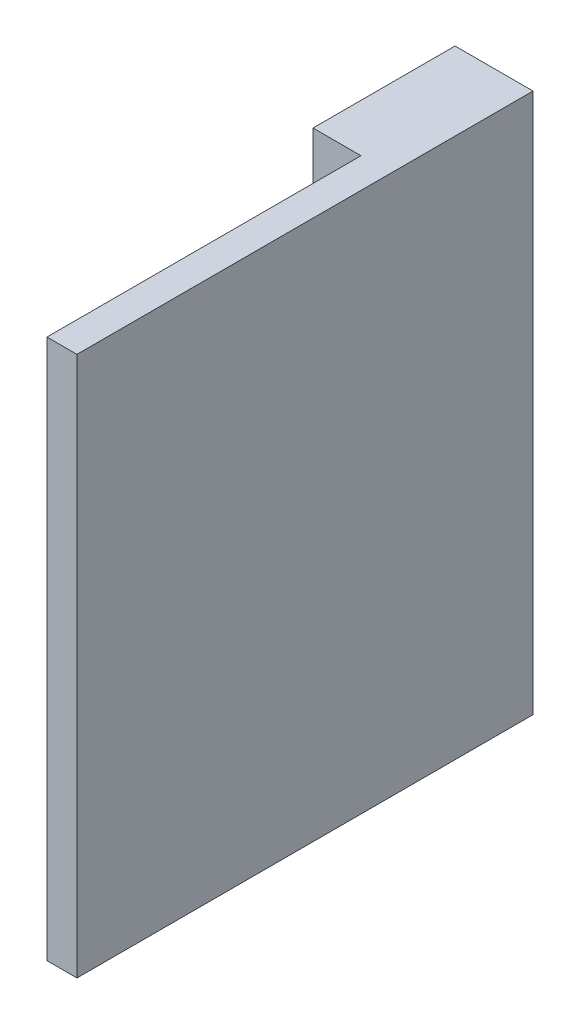
ISO-10303-21;
HEADER;
FILE_DESCRIPTION(('STEP AP214'),'2;1');
FILE_NAME('part.step','',(''),(''),'','','');
FILE_SCHEMA(('AUTOMOTIVE_DESIGN { 1 0 10303 214 1 1 1 1 }'));
ENDSEC;
DATA;
#1=APPLICATION_CONTEXT('core data for automotive mechanical design processes');
#2=APPLICATION_PROTOCOL_DEFINITION('international standard','automotive_design',2000,#1);
#3=PRODUCT_CONTEXT('',#1,'mechanical');
#4=PRODUCT('Part','Part','',(#3));
#5=PRODUCT_RELATED_PRODUCT_CATEGORY('part','',(#4));
#6=PRODUCT_DEFINITION_FORMATION('','',#4);
#7=PRODUCT_DEFINITION_CONTEXT('part definition',#1,'design');
#8=PRODUCT_DEFINITION('design','',#6,#7);
#9=PRODUCT_DEFINITION_SHAPE('','',#8);
#10=(LENGTH_UNIT() NAMED_UNIT(*) SI_UNIT(.MILLI.,.METRE.));
#11=(NAMED_UNIT(*) PLANE_ANGLE_UNIT() SI_UNIT($,.RADIAN.));
#12=(NAMED_UNIT(*) SI_UNIT($,.STERADIAN.) SOLID_ANGLE_UNIT());
#13=UNCERTAINTY_MEASURE_WITH_UNIT(LENGTH_MEASURE(1.E-05),#10,'distance_accuracy_value','');
#14=(GEOMETRIC_REPRESENTATION_CONTEXT(3) GLOBAL_UNCERTAINTY_ASSIGNED_CONTEXT((#13)) GLOBAL_UNIT_ASSIGNED_CONTEXT((#10,
#11,#12)) REPRESENTATION_CONTEXT('',''));
#15=CARTESIAN_POINT('',(0.,0.,0.));
#16=DIRECTION('',(0.,0.,1.));
#17=DIRECTION('',(1.,0.,0.));
#18=AXIS2_PLACEMENT_3D('',#15,#16,#17);
#19=CARTESIAN_POINT('',(0.,2700.,-1570.));
#20=DIRECTION('',(1.,0.,0.));
#21=DIRECTION('',(0.,0.,-1.));
#22=AXIS2_PLACEMENT_3D('',#19,#20,#21);
#23=PLANE('',#22);
#24=DIRECTION('',(0.,0.,1.));
#25=VECTOR('',#24,1.);
#26=CARTESIAN_POINT('',(0.,0.,-1570.));
#27=LINE('',#26,#25);
#28=CARTESIAN_POINT('',(0.,0.,-1570.));
#29=VERTEX_POINT('',#28);
#30=CARTESIAN_POINT('',(0.,0.,0.));
#31=VERTEX_POINT('',#30);
#32=EDGE_CURVE('E117',#29,#31,#27,.T.);
#33=ORIENTED_EDGE('',*,*,#32,.T.);
#34=DIRECTION('',(0.,-1.,0.));
#35=VECTOR('',#34,1.);
#36=CARTESIAN_POINT('',(0.,2700.,0.));
#37=LINE('',#36,#35);
#38=CARTESIAN_POINT('',(0.,2700.,0.));
#39=VERTEX_POINT('',#38);
#40=EDGE_CURVE('E11',#39,#31,#37,.T.);
#41=ORIENTED_EDGE('',*,*,#40,.F.);
#42=DIRECTION('',(0.,0.,1.));
#43=VECTOR('',#42,1.);
#44=CARTESIAN_POINT('',(0.,2700.,-1570.));
#45=LINE('',#44,#43);
#46=CARTESIAN_POINT('',(0.,2700.,-1570.));
#47=VERTEX_POINT('',#46);
#48=EDGE_CURVE('E127',#47,#39,#45,.T.);
#49=ORIENTED_EDGE('',*,*,#48,.F.);
#50=DIRECTION('',(0.,-1.,0.));
#51=VECTOR('',#50,1.);
#52=CARTESIAN_POINT('',(0.,2700.,-1570.));
#53=LINE('',#52,#51);
#54=EDGE_CURVE('E113',#47,#29,#53,.T.);
#55=ORIENTED_EDGE('',*,*,#54,.T.);
#56=EDGE_LOOP('',(#33,#41,#49,#55));
#57=FACE_BOUND('',#56,.T.);
#58=ADVANCED_FACE('F33',(#57),#23,.F.);
#59=CARTESIAN_POINT('',(0.,2700.,0.));
#60=DIRECTION('',(0.,0.,-1.));
#61=DIRECTION('',(-1.,0.,0.));
#62=AXIS2_PLACEMENT_3D('',#59,#60,#61);
#63=PLANE('',#62);
#64=DIRECTION('',(1.,0.,0.));
#65=VECTOR('',#64,1.);
#66=CARTESIAN_POINT('',(0.,0.,0.));
#67=LINE('',#66,#65);
#68=CARTESIAN_POINT('',(150.,0.,0.));
#69=VERTEX_POINT('',#68);
#70=EDGE_CURVE('E120',#31,#69,#67,.T.);
#71=ORIENTED_EDGE('',*,*,#70,.T.);
#72=DIRECTION('',(0.,-1.,0.));
#73=VECTOR('',#72,1.);
#74=CARTESIAN_POINT('',(150.,2700.,0.));
#75=LINE('',#74,#73);
#76=CARTESIAN_POINT('',(150.,2700.,0.));
#77=VERTEX_POINT('',#76);
#78=EDGE_CURVE('E41',#77,#69,#75,.T.);
#79=ORIENTED_EDGE('',*,*,#78,.F.);
#80=DIRECTION('',(1.,0.,0.));
#81=VECTOR('',#80,1.);
#82=CARTESIAN_POINT('',(0.,2700.,0.));
#83=LINE('',#82,#81);
#84=EDGE_CURVE('E86',#39,#77,#83,.T.);
#85=ORIENTED_EDGE('',*,*,#84,.F.);
#86=ORIENTED_EDGE('',*,*,#40,.T.);
#87=EDGE_LOOP('',(#71,#79,#85,#86));
#88=FACE_BOUND('',#87,.T.);
#89=ADVANCED_FACE('F151',(#88),#63,.F.);
#90=CARTESIAN_POINT('',(150.,2700.,0.));
#91=DIRECTION('',(-1.,0.,0.));
#92=DIRECTION('',(0.,0.,1.));
#93=AXIS2_PLACEMENT_3D('',#90,#91,#92);
#94=PLANE('',#93);
#95=DIRECTION('',(0.,0.,-1.));
#96=VECTOR('',#95,1.);
#97=CARTESIAN_POINT('',(150.,0.,0.));
#98=LINE('',#97,#96);
#99=CARTESIAN_POINT('',(150.,0.,-2280.));
#100=VERTEX_POINT('',#99);
#101=EDGE_CURVE('E122',#69,#100,#98,.T.);
#102=ORIENTED_EDGE('',*,*,#101,.T.);
#103=DIRECTION('',(0.,-1.,0.));
#104=VECTOR('',#103,1.);
#105=CARTESIAN_POINT('',(150.,2700.,-2280.));
#106=LINE('',#105,#104);
#107=CARTESIAN_POINT('',(150.,2700.,-2280.));
#108=VERTEX_POINT('',#107);
#109=EDGE_CURVE('E108',#108,#100,#106,.T.);
#110=ORIENTED_EDGE('',*,*,#109,.F.);
#111=DIRECTION('',(0.,0.,-1.));
#112=VECTOR('',#111,1.);
#113=CARTESIAN_POINT('',(150.,2700.,0.));
#114=LINE('',#113,#112);
#115=EDGE_CURVE('E99',#77,#108,#114,.T.);
#116=ORIENTED_EDGE('',*,*,#115,.F.);
#117=ORIENTED_EDGE('',*,*,#78,.T.);
#118=EDGE_LOOP('',(#102,#110,#116,#117));
#119=FACE_BOUND('',#118,.T.);
#120=ADVANCED_FACE('F133',(#119),#94,.F.);
#121=CARTESIAN_POINT('',(150.,2700.,-2280.));
#122=DIRECTION('',(0.,0.,1.));
#123=DIRECTION('',(1.,0.,0.));
#124=AXIS2_PLACEMENT_3D('',#121,#122,#123);
#125=PLANE('',#124);
#126=DIRECTION('',(-1.,0.,0.));
#127=VECTOR('',#126,1.);
#128=CARTESIAN_POINT('',(150.,0.,-2280.));
#129=LINE('',#128,#127);
#130=CARTESIAN_POINT('',(-240.,0.,-2280.));
#131=VERTEX_POINT('',#130);
#132=EDGE_CURVE('E107',#100,#131,#129,.T.);
#133=ORIENTED_EDGE('',*,*,#132,.T.);
#134=DIRECTION('',(0.,-1.,0.));
#135=VECTOR('',#134,1.);
#136=CARTESIAN_POINT('',(-240.,2700.,-2280.));
#137=LINE('',#136,#135);
#138=CARTESIAN_POINT('',(-240.,2700.,-2280.));
#139=VERTEX_POINT('',#138);
#140=EDGE_CURVE('E104',#139,#131,#137,.T.);
#141=ORIENTED_EDGE('',*,*,#140,.F.);
#142=DIRECTION('',(-1.,0.,0.));
#143=VECTOR('',#142,1.);
#144=CARTESIAN_POINT('',(150.,2700.,-2280.));
#145=LINE('',#144,#143);
#146=EDGE_CURVE('E93',#108,#139,#145,.T.);
#147=ORIENTED_EDGE('',*,*,#146,.F.);
#148=ORIENTED_EDGE('',*,*,#109,.T.);
#149=EDGE_LOOP('',(#133,#141,#147,#148));
#150=FACE_BOUND('',#149,.T.);
#151=ADVANCED_FACE('F105',(#150),#125,.F.);
#152=CARTESIAN_POINT('',(-240.,2700.,-2280.));
#153=DIRECTION('',(1.,0.,0.));
#154=DIRECTION('',(0.,0.,-1.));
#155=AXIS2_PLACEMENT_3D('',#152,#153,#154);
#156=PLANE('',#155);
#157=DIRECTION('',(0.,0.,1.));
#158=VECTOR('',#157,1.);
#159=CARTESIAN_POINT('',(-240.,0.,-2280.));
#160=LINE('',#159,#158);
#161=CARTESIAN_POINT('',(-240.,0.,-1570.));
#162=VERTEX_POINT('',#161);
#163=EDGE_CURVE('E72',#131,#162,#160,.T.);
#164=ORIENTED_EDGE('',*,*,#163,.T.);
#165=DIRECTION('',(0.,-1.,0.));
#166=VECTOR('',#165,1.);
#167=CARTESIAN_POINT('',(-240.,2700.,-1570.));
#168=LINE('',#167,#166);
#169=CARTESIAN_POINT('',(-240.,2700.,-1570.));
#170=VERTEX_POINT('',#169);
#171=EDGE_CURVE('E109',#170,#162,#168,.T.);
#172=ORIENTED_EDGE('',*,*,#171,.F.);
#173=DIRECTION('',(0.,0.,1.));
#174=VECTOR('',#173,1.);
#175=CARTESIAN_POINT('',(-240.,2700.,-2280.));
#176=LINE('',#175,#174);
#177=EDGE_CURVE('E97',#139,#170,#176,.T.);
#178=ORIENTED_EDGE('',*,*,#177,.F.);
#179=ORIENTED_EDGE('',*,*,#140,.T.);
#180=EDGE_LOOP('',(#164,#172,#178,#179));
#181=FACE_BOUND('',#180,.T.);
#182=ADVANCED_FACE('F111',(#181),#156,.F.);
#183=CARTESIAN_POINT('',(-240.,2700.,-1570.));
#184=DIRECTION('',(0.,0.,-1.));
#185=DIRECTION('',(-1.,0.,0.));
#186=AXIS2_PLACEMENT_3D('',#183,#184,#185);
#187=PLANE('',#186);
#188=DIRECTION('',(1.,0.,0.));
#189=VECTOR('',#188,1.);
#190=CARTESIAN_POINT('',(-240.,0.,-1570.));
#191=LINE('',#190,#189);
#192=EDGE_CURVE('E78',#162,#29,#191,.T.);
#193=ORIENTED_EDGE('',*,*,#192,.T.);
#194=ORIENTED_EDGE('',*,*,#54,.F.);
#195=DIRECTION('',(1.,0.,0.));
#196=VECTOR('',#195,1.);
#197=CARTESIAN_POINT('',(-240.,2700.,-1570.));
#198=LINE('',#197,#196);
#199=EDGE_CURVE('E49',#170,#47,#198,.T.);
#200=ORIENTED_EDGE('',*,*,#199,.F.);
#201=ORIENTED_EDGE('',*,*,#171,.T.);
#202=EDGE_LOOP('',(#193,#194,#200,#201));
#203=FACE_BOUND('',#202,.T.);
#204=ADVANCED_FACE('F140',(#203),#187,.F.);
#205=CARTESIAN_POINT('',(0.,2700.,0.));
#206=DIRECTION('',(0.,1.,0.));
#207=DIRECTION('',(0.,0.,1.));
#208=AXIS2_PLACEMENT_3D('',#205,#206,#207);
#209=PLANE('',#208);
#210=ORIENTED_EDGE('',*,*,#48,.T.);
#211=ORIENTED_EDGE('',*,*,#84,.T.);
#212=ORIENTED_EDGE('',*,*,#115,.T.);
#213=ORIENTED_EDGE('',*,*,#146,.T.);
#214=ORIENTED_EDGE('',*,*,#177,.T.);
#215=ORIENTED_EDGE('',*,*,#199,.T.);
#216=EDGE_LOOP('',(#210,#211,#212,#213,#214,#215));
#217=FACE_BOUND('',#216,.T.);
#218=ADVANCED_FACE('F95',(#217),#209,.T.);
#219=CARTESIAN_POINT('',(0.,0.,0.));
#220=DIRECTION('',(0.,1.,0.));
#221=DIRECTION('',(0.,0.,1.));
#222=AXIS2_PLACEMENT_3D('',#219,#220,#221);
#223=PLANE('',#222);
#224=ORIENTED_EDGE('',*,*,#32,.F.);
#225=ORIENTED_EDGE('',*,*,#192,.F.);
#226=ORIENTED_EDGE('',*,*,#163,.F.);
#227=ORIENTED_EDGE('',*,*,#132,.F.);
#228=ORIENTED_EDGE('',*,*,#101,.F.);
#229=ORIENTED_EDGE('',*,*,#70,.F.);
#230=EDGE_LOOP('',(#224,#225,#226,#227,#228,#229));
#231=FACE_BOUND('',#230,.T.);
#232=ADVANCED_FACE('F136',(#231),#223,.F.);
#233=CLOSED_SHELL('',(#58,#89,#120,#151,#182,#204,#218,#232));
#234=MANIFOLD_SOLID_BREP('B2',#233);
#235=ADVANCED_BREP_SHAPE_REPRESENTATION('',(#18,#234),#14);
#236=SHAPE_DEFINITION_REPRESENTATION(#9,#235);
ENDSEC;
END-ISO-10303-21;
